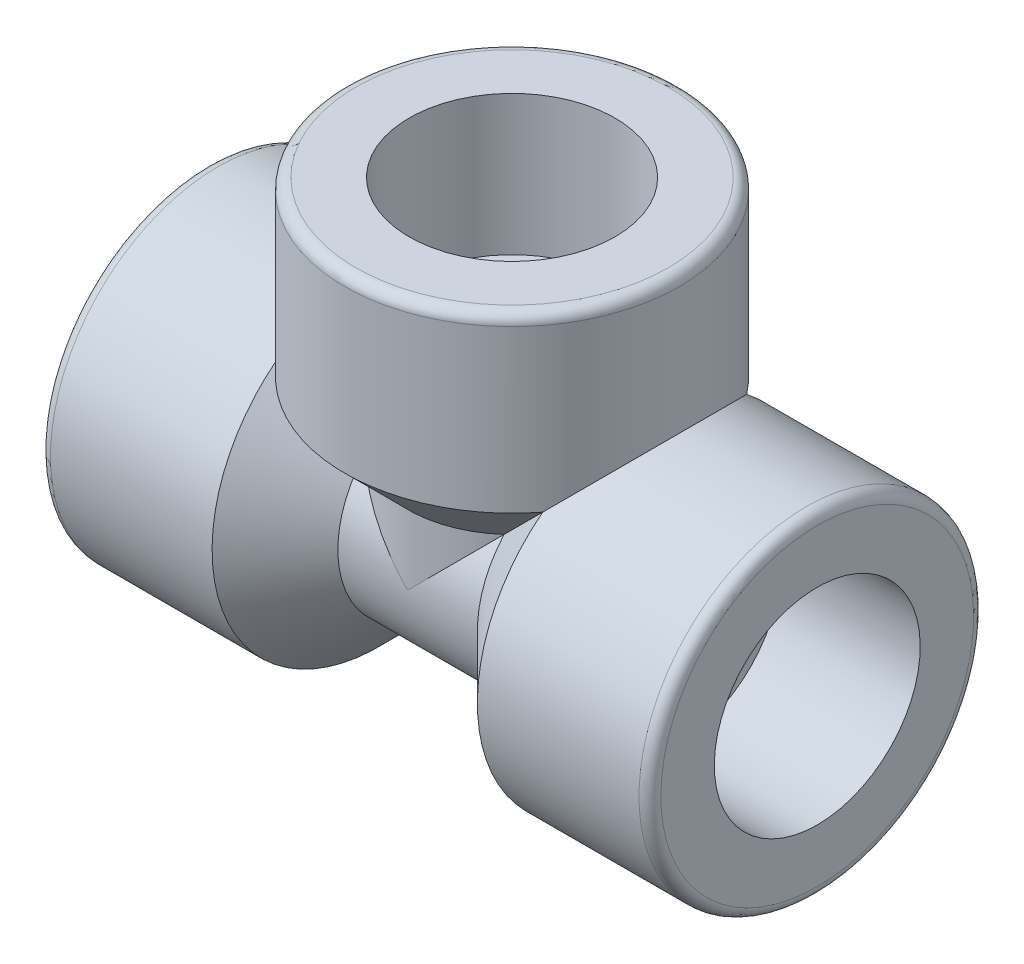
ISO-10303-21;
HEADER;
FILE_DESCRIPTION(('STEP AP214'),'2;1');
FILE_NAME('part.step','',(''),(''),'','','');
FILE_SCHEMA(('AUTOMOTIVE_DESIGN { 1 0 10303 214 1 1 1 1 }'));
ENDSEC;
DATA;
#1=APPLICATION_CONTEXT('core data for automotive mechanical design processes');
#2=APPLICATION_PROTOCOL_DEFINITION('international standard','automotive_design',2000,#1);
#3=PRODUCT_CONTEXT('',#1,'mechanical');
#4=PRODUCT('Part','Part','',(#3));
#5=PRODUCT_RELATED_PRODUCT_CATEGORY('part','',(#4));
#6=PRODUCT_DEFINITION_FORMATION('','',#4);
#7=PRODUCT_DEFINITION_CONTEXT('part definition',#1,'design');
#8=PRODUCT_DEFINITION('design','',#6,#7);
#9=PRODUCT_DEFINITION_SHAPE('','',#8);
#10=(LENGTH_UNIT() NAMED_UNIT(*) SI_UNIT(.MILLI.,.METRE.));
#11=(NAMED_UNIT(*) PLANE_ANGLE_UNIT() SI_UNIT($,.RADIAN.));
#12=(NAMED_UNIT(*) SI_UNIT($,.STERADIAN.) SOLID_ANGLE_UNIT());
#13=UNCERTAINTY_MEASURE_WITH_UNIT(LENGTH_MEASURE(1.E-05),#10,'distance_accuracy_value','');
#14=(GEOMETRIC_REPRESENTATION_CONTEXT(3) GLOBAL_UNCERTAINTY_ASSIGNED_CONTEXT((#13)) GLOBAL_UNIT_ASSIGNED_CONTEXT((#10,
#11,#12)) REPRESENTATION_CONTEXT('',''));
#15=CARTESIAN_POINT('',(0.,0.,0.));
#16=DIRECTION('',(0.,0.,1.));
#17=DIRECTION('',(1.,0.,0.));
#18=AXIS2_PLACEMENT_3D('',#15,#16,#17);
#19=CARTESIAN_POINT('',(0.,0.,0.));
#20=DIRECTION('',(1.,0.,0.));
#21=DIRECTION('',(0.,1.,0.));
#22=AXIS2_PLACEMENT_3D('',#19,#20,#21);
#23=CYLINDRICAL_SURFACE('',#22,4.191);
#24=CARTESIAN_POINT('',(11.43,0.,0.));
#25=DIRECTION('',(-1.,0.,0.));
#26=DIRECTION('',(0.,-1.,0.));
#27=AXIS2_PLACEMENT_3D('',#24,#25,#26);
#28=CIRCLE('',#27,4.191);
#29=CARTESIAN_POINT('',(11.43,-4.19100000000007,0.));
#30=VERTEX_POINT('',#29);
#31=EDGE_CURVE('E159',#30,#30,#28,.T.);
#32=ORIENTED_EDGE('',*,*,#31,.F.);
#33=EDGE_LOOP('',(#32));
#34=FACE_BOUND('',#33,.T.);
#35=CARTESIAN_POINT('',(-11.43,0.,0.));
#36=DIRECTION('',(1.,0.,0.));
#37=DIRECTION('',(0.,1.,0.));
#38=AXIS2_PLACEMENT_3D('',#35,#36,#37);
#39=CIRCLE('',#38,4.191);
#40=CARTESIAN_POINT('',(-11.43,4.19099999999999,0.));
#41=VERTEX_POINT('',#40);
#42=EDGE_CURVE('E288',#41,#41,#39,.T.);
#43=ORIENTED_EDGE('',*,*,#42,.F.);
#44=EDGE_LOOP('',(#43));
#45=FACE_BOUND('',#44,.T.);
#46=CARTESIAN_POINT('',(0.,0.,0.));
#47=DIRECTION('',(0.707106781186548,-0.707106781186548,0.));
#48=DIRECTION('',(0.707106781186548,0.707106781186547,0.));
#49=AXIS2_PLACEMENT_3D('',#46,#47,#48);
#50=ELLIPSE('',#49,5.92696903990564,4.191);
#51=CARTESIAN_POINT('',(0.,0.,-4.191));
#52=VERTEX_POINT('',#51);
#53=CARTESIAN_POINT('',(0.,0.,4.191));
#54=VERTEX_POINT('',#53);
#55=EDGE_CURVE('E110',#52,#54,#50,.T.);
#56=ORIENTED_EDGE('',*,*,#55,.F.);
#57=CARTESIAN_POINT('',(0.,0.,0.));
#58=DIRECTION('',(0.707106781186548,0.707106781186547,0.));
#59=DIRECTION('',(0.707106781186548,-0.707106781186548,0.));
#60=AXIS2_PLACEMENT_3D('',#57,#58,#59);
#61=ELLIPSE('',#60,5.92696903990564,4.191);
#62=EDGE_CURVE('E147',#54,#52,#61,.F.);
#63=ORIENTED_EDGE('',*,*,#62,.F.);
#64=EDGE_LOOP('',(#56,#63));
#65=FACE_BOUND('',#64,.T.);
#66=ADVANCED_FACE('F96',(#34,#45,#65),#23,.F.);
#67=CARTESIAN_POINT('',(0.,0.,0.));
#68=DIRECTION('',(1.,0.,0.));
#69=DIRECTION('',(0.,1.,0.));
#70=AXIS2_PLACEMENT_3D('',#67,#68,#69);
#71=CYLINDRICAL_SURFACE('',#70,11.557);
#72=CARTESIAN_POINT('',(-20.32635,0.,0.));
#73=DIRECTION('',(1.,0.,0.));
#74=DIRECTION('',(0.,1.,0.));
#75=AXIS2_PLACEMENT_3D('',#72,#73,#74);
#76=CIRCLE('',#75,11.557);
#77=CARTESIAN_POINT('',(-20.32635,11.557,0.));
#78=VERTEX_POINT('',#77);
#79=EDGE_CURVE('E104',#78,#78,#76,.T.);
#80=ORIENTED_EDGE('',*,*,#79,.T.);
#81=EDGE_LOOP('',(#80));
#82=FACE_BOUND('',#81,.T.);
#83=CARTESIAN_POINT('',(0.,0.,0.));
#84=DIRECTION('',(0.707106781186549,0.707106781186546,0.));
#85=DIRECTION('',(0.707106781186546,-0.707106781186549,0.));
#86=AXIS2_PLACEMENT_3D('',#83,#84,#85);
#87=ELLIPSE('',#86,16.3440661403458,11.557);
#88=CARTESIAN_POINT('',(-9.16304999999999,9.16305000000002,-7.04292295126813));
#89=VERTEX_POINT('',#88);
#90=CARTESIAN_POINT('',(-9.16304999999999,9.16305000000003,7.04292295126813));
#91=VERTEX_POINT('',#90);
#92=EDGE_CURVE('E117',#89,#91,#87,.T.);
#93=ORIENTED_EDGE('',*,*,#92,.F.);
#94=CARTESIAN_POINT('',(-9.16305,0.,0.));
#95=DIRECTION('',(1.,0.,0.));
#96=DIRECTION('',(0.,1.,0.));
#97=AXIS2_PLACEMENT_3D('',#94,#95,#96);
#98=CIRCLE('',#97,11.557);
#99=EDGE_CURVE('E294',#91,#89,#98,.T.);
#100=ORIENTED_EDGE('',*,*,#99,.F.);
#101=EDGE_LOOP('',(#93,#100));
#102=FACE_BOUND('',#101,.T.);
#103=ADVANCED_FACE('F243',(#82,#102),#71,.T.);
#104=CARTESIAN_POINT('',(-9.16305,0.,0.));
#105=DIRECTION('',(-1.,0.,0.));
#106=DIRECTION('',(0.,-1.,0.));
#107=AXIS2_PLACEMENT_3D('',#104,#105,#106);
#108=CONICAL_SURFACE('',#107,11.557,0.785398163397451);
#109=CARTESIAN_POINT('',(1.19697500001641,-1.19697500001643,4.4342035988794E-06));
#110=CARTESIAN_POINT('',(1.19697836620666,-1.19697836620423,-0.0376505705711459));
#111=CARTESIAN_POINT('',(1.19608613541275,-1.19608613540982,-0.0752938622259102));
#112=CARTESIAN_POINT('',(1.19254436069482,-1.19254436069239,-0.150401745617256));
#113=CARTESIAN_POINT('',(1.18989543995814,-1.18989543995672,-0.187866395981631));
#114=CARTESIAN_POINT('',(1.17939486010733,-1.1793948601077,-0.299466042307876));
#115=CARTESIAN_POINT('',(1.16898874466563,-1.16898874466556,-0.373145913181798));
#116=CARTESIAN_POINT('',(1.14229768219998,-1.14229768219964,-0.516557276062976));
#117=CARTESIAN_POINT('',(1.12614636715457,-1.12614636715439,-0.586339887954223));
#118=CARTESIAN_POINT('',(1.08873038336302,-1.08873038336298,-0.723152238154118));
#119=CARTESIAN_POINT('',(1.06746102034273,-1.06746102034267,-0.790179382681073));
#120=CARTESIAN_POINT('',(1.02180582651157,-1.02180582651151,-0.917917484823124));
#121=CARTESIAN_POINT('',(0.997625241455938,-0.997625241455905,-0.978776926741604));
#122=CARTESIAN_POINT('',(0.946060780068239,-0.946060780068226,-1.09767143684221));
#123=CARTESIAN_POINT('',(0.91867764128022,-0.918677641280203,-1.15570715098273));
#124=CARTESIAN_POINT('',(0.832254105448934,-0.832254105448912,-1.32637374393476));
#125=CARTESIAN_POINT('',(0.769179137362862,-0.769179137362846,-1.43492836300394));
#126=CARTESIAN_POINT('',(0.640377669111118,-0.640377669111109,-1.63531666088378));
#127=CARTESIAN_POINT('',(0.575131914273946,-0.575131914273939,-1.72778686550953));
#128=CARTESIAN_POINT('',(0.440201699604737,-0.440201699604734,-1.90558001014071));
#129=CARTESIAN_POINT('',(0.370525893855268,-0.370525893855269,-1.99091617438732));
#130=CARTESIAN_POINT('',(0.226850905695857,-0.226850905695859,-2.15680932278225));
#131=CARTESIAN_POINT('',(0.152806219096202,-0.152806219096201,-2.23728670692094));
#132=CARTESIAN_POINT('',(0.00206906022920148,-0.00206906022919983,-2.39314866258522));
#133=CARTESIAN_POINT('',(-0.0746241137424896,0.0746241137424894,-2.46853186854515));
#134=CARTESIAN_POINT('',(-0.225511065887696,0.225511065887695,-2.61064517767748));
#135=CARTESIAN_POINT('',(-0.299588591410893,0.299588591410891,-2.677623507081));
#136=CARTESIAN_POINT('',(-0.449216998526755,0.449216998526755,-2.80821270787426));
#137=CARTESIAN_POINT('',(-0.524768023636592,0.524768023636592,-2.87182324898128));
#138=CARTESIAN_POINT('',(-0.752505323377614,0.752505323377615,-3.05765742051496));
#139=CARTESIAN_POINT('',(-0.906470895010872,0.906470895010871,-3.17552451823402));
#140=CARTESIAN_POINT('',(-1.22077330781734,1.22077330781734,-3.40429728513316));
#141=CARTESIAN_POINT('',(-1.38117591445579,1.38117591445579,-3.51501991967286));
#142=CARTESIAN_POINT('',(-1.70474656907484,1.70474656907484,-3.72888530479324));
#143=CARTESIAN_POINT('',(-1.86791815238902,1.86791815238902,-3.83201730104152));
#144=CARTESIAN_POINT('',(-2.2693005762169,2.2693005762169,-4.07640708832778));
#145=CARTESIAN_POINT('',(-2.5085666082519,2.5085666082519,-4.21418886034261));
#146=CARTESIAN_POINT('',(-2.98998716639616,2.98998716639617,-4.47931662528661));
#147=CARTESIAN_POINT('',(-3.23214213696036,3.23214213696037,-4.60666098810027));
#148=CARTESIAN_POINT('',(-3.71857634660193,3.71857634660194,-4.852867354527));
#149=CARTESIAN_POINT('',(-3.96285548011577,3.96285548011577,-4.97172977699078));
#150=CARTESIAN_POINT('',(-4.45307442708693,4.45307442708694,-5.20241628188884));
#151=CARTESIAN_POINT('',(-4.69901432165255,4.69901432165256,-5.31424001777425));
#152=CARTESIAN_POINT('',(-5.43479618372402,5.43479618372403,-5.63907088831386));
#153=CARTESIAN_POINT('',(-5.92655595657114,5.92655595657115,-5.84339370881202));
#154=CARTESIAN_POINT('',(-6.91340923267632,6.91340923267634,-6.23455831723592));
#155=CARTESIAN_POINT('',(-7.40850220970608,7.4085022097061,-6.42140279824828));
#156=CARTESIAN_POINT('',(-8.5920904066062,8.59209040660622,-6.85064949322347));
#157=CARTESIAN_POINT('',(-9.28172109306981,9.28172109306984,-7.08677498511869));
#158=CARTESIAN_POINT('',(-10.6642645502998,10.6642645502999,-7.53932345815605));
#159=CARTESIAN_POINT('',(-11.3571777398874,11.3571777398874,-7.75574384973766));
#160=CARTESIAN_POINT('',(-12.7495452918229,12.7495452918229,-8.17426388250147));
#161=CARTESIAN_POINT('',(-13.44901384512,13.4490138451201,-8.37626877130608));
#162=CARTESIAN_POINT('',(-14.4994490088823,14.4994490088824,-8.66962631683147));
#163=CARTESIAN_POINT('',(-14.8497498014326,14.8497498014326,-8.76579094339621));
#164=CARTESIAN_POINT('',(-15.5507431988797,15.5507431988798,-8.95518609790618));
#165=CARTESIAN_POINT('',(-15.9014357985876,15.9014357985876,-9.04841666424365));
#166=CARTESIAN_POINT('',(-16.2523030226211,16.2523030226211,-9.14031718511586));
#167=B_SPLINE_CURVE_WITH_KNOTS('',3,(#109,#110,#111,#112,#113,#114,#115,#116,#117,#118,#119,
#120,#121,#122,#123,#124,#125,#126,#127,#128,#129,#130,#131,#132,#133,#134,#135,#136,#137,#138,
#139,#140,#141,#142,#143,#144,#145,#146,#147,#148,#149,#150,#151,#152,#153,#154,#155,#156,#157,
#158,#159,#160,#161,#162,#163,#164,#165,#166),.UNSPECIFIED.,.F.,.F.,(4,2,2,2,2,2,2,2,2,2,2,2,2,
2,2,2,2,2,2,2,2,2,2,2,2,2,2,2,4),(0.,0.112921576811569,0.2258031160053,0.450556616219099,
0.670391751304081,0.890429292952005,1.09962282808023,1.30876828072101,1.72920119538149,
2.12071729340295,2.51149076348252,2.90751364595729,3.30364227020766,3.67659711967938,
4.04958847774958,4.79205608614872,5.54915999472527,6.30731669685217,7.40312539873707,
8.49910491929498,9.59503028126114,10.6910095588379,12.8651998588656,15.0390546029517,
18.049139580089,21.0596195605723,24.0883467620669,25.6022820115838,27.1161974429796),.UNSPECIFIED.);
#168=CARTESIAN_POINT('',(-4.81965000000002,4.81965000000002,-5.36721518457195));
#169=VERTEX_POINT('',#168);
#170=EDGE_CURVE('E274',#169,#89,#167,.T.);
#171=ORIENTED_EDGE('',*,*,#170,.F.);
#172=CARTESIAN_POINT('',(-4.81965000000002,0.,0.));
#173=DIRECTION('',(1.,0.,0.));
#174=DIRECTION('',(0.,1.,0.));
#175=AXIS2_PLACEMENT_3D('',#172,#173,#174);
#176=CIRCLE('',#175,7.2136);
#177=CARTESIAN_POINT('',(-4.81965000000002,4.81965000000002,5.36721518457195));
#178=VERTEX_POINT('',#177);
#179=EDGE_CURVE('E291',#178,#169,#176,.T.);
#180=ORIENTED_EDGE('',*,*,#179,.F.);
#181=CARTESIAN_POINT('',(-16.0854125900472,16.0854125900472,9.09650172002422));
#182=CARTESIAN_POINT('',(-15.4339510477104,15.4339510477104,8.92495006252489));
#183=CARTESIAN_POINT('',(-14.7830664804659,14.783066480466,8.74890599160706));
#184=CARTESIAN_POINT('',(-13.4825170343036,13.4825170343037,8.38554939927521));
#185=CARTESIAN_POINT('',(-12.8328529838987,12.8328529838987,8.1982309594175));
#186=CARTESIAN_POINT('',(-11.4523427840635,11.4523427840635,7.78534805823336));
#187=CARTESIAN_POINT('',(-10.721766234564,10.7217662345641,7.55795905302697));
#188=CARTESIAN_POINT('',(-9.628722902629,9.62872290262903,7.20044870990384));
#189=CARTESIAN_POINT('',(-9.26490716180718,9.26490716180721,7.07856296971851));
#190=CARTESIAN_POINT('',(-8.53837371860589,8.53837371860592,6.82843683144562));
#191=CARTESIAN_POINT('',(-8.17565599271068,8.17565599271071,6.70019657048659));
#192=CARTESIAN_POINT('',(-7.46894056942904,7.46894056942907,6.44261722420037));
#193=CARTESIAN_POINT('',(-7.12487963760278,7.1248796376028,6.3136260358246));
#194=CARTESIAN_POINT('',(-6.43829917672166,6.43829917672168,6.04769566224292));
#195=CARTESIAN_POINT('',(-6.0957796143418,6.09577961434182,5.91075664977029));
#196=CARTESIAN_POINT('',(-5.41231293183799,5.412312931838,5.62714519981428));
#197=CARTESIAN_POINT('',(-5.07136813721994,5.07136813721996,5.48046149484933));
#198=CARTESIAN_POINT('',(-4.39220551291607,4.39220551291608,5.17530102861037));
#199=CARTESIAN_POINT('',(-4.05398703052978,4.05398703052979,5.01682718889586));
#200=CARTESIAN_POINT('',(-3.40735745009627,3.40735745009628,4.69772284873583));
#201=CARTESIAN_POINT('',(-3.098672176401,3.09867217640101,4.53821659689964));
#202=CARTESIAN_POINT('',(-2.63892143850963,2.63892143850964,4.28636114320928));
#203=CARTESIAN_POINT('',(-2.48614248669571,2.48614248669572,4.20026418354079));
#204=CARTESIAN_POINT('',(-2.18200613151679,2.1820061315168,4.02319275067455));
#205=CARTESIAN_POINT('',(-2.03064866796119,2.03064866796119,3.93221848510265));
#206=CARTESIAN_POINT('',(-1.72937060093615,1.72937060093615,3.74431582337524));
#207=CARTESIAN_POINT('',(-1.57945407736739,1.57945407736739,3.64737428037004));
#208=CARTESIAN_POINT('',(-1.28195932291795,1.28195932291795,3.44658856595852));
#209=CARTESIAN_POINT('',(-1.13438085421445,1.13438085421445,3.34274510225873));
#210=CARTESIAN_POINT('',(-0.84252062063191,0.842520620631908,3.12675251979719));
#211=CARTESIAN_POINT('',(-0.698234514074487,0.698234514074483,3.01461527885065));
#212=CARTESIAN_POINT('',(-0.485112848355794,0.48511284835579,2.83850158909801));
#213=CARTESIAN_POINT('',(-0.41463646990944,0.414636469909438,2.7784910688848));
#214=CARTESIAN_POINT('',(-0.275009416736295,0.275009416736294,2.65546674204897));
#215=CARTESIAN_POINT('',(-0.205858641577127,0.205858641577128,2.59245316421967));
#216=CARTESIAN_POINT('',(-0.0603972809061026,0.0603972809061043,2.45469154875406));
#217=CARTESIAN_POINT('',(0.0156930150347754,-0.0156930150347735,2.37947549517443));
#218=CARTESIAN_POINT('',(0.165201781596407,-0.165201781596405,2.22397690872858));
#219=CARTESIAN_POINT('',(0.238621466927465,-0.238621466927463,2.14369672585511));
#220=CARTESIAN_POINT('',(0.380829912622356,-0.380829912622353,1.97846843786975));
#221=CARTESIAN_POINT('',(0.449674576272804,-0.449674576272801,1.89361750921734));
#222=CARTESIAN_POINT('',(0.582963846973055,-0.582963846973053,1.71687379584102));
#223=CARTESIAN_POINT('',(0.647399829764682,-0.647399829764683,1.62496791538749));
#224=CARTESIAN_POINT('',(0.774547331373884,-0.774547331373879,1.42589356088552));
#225=CARTESIAN_POINT('',(0.83678339378687,-0.836783393786855,1.31809968973217));
#226=CARTESIAN_POINT('',(0.922038223437998,-0.922038223437981,1.14870454232127));
#227=CARTESIAN_POINT('',(0.949048443063641,-0.949048443063625,1.09111076241334));
#228=CARTESIAN_POINT('',(0.999906854131563,-0.99990685413152,0.973151884775891));
#229=CARTESIAN_POINT('',(1.02375432180886,-1.02375432180879,0.912786156953264));
#230=CARTESIAN_POINT('',(1.06887130419532,-1.06887130419528,0.785870182721644));
#231=CARTESIAN_POINT('',(1.08992247138616,-1.08992247138618,0.719162823306451));
#232=CARTESIAN_POINT('',(1.12694563962336,-1.12694563962316,0.583027930088218));
#233=CARTESIAN_POINT('',(1.14292218499438,-1.14292218499391,0.51360289291272));
#234=CARTESIAN_POINT('',(1.16931558766293,-1.16931558766304,0.370965823635463));
#235=CARTESIAN_POINT('',(1.17960141602561,-1.1796014160266,0.297703966159117));
#236=CARTESIAN_POINT('',(1.18997927857259,-1.18997927857111,0.186751235930064));
#237=CARTESIAN_POINT('',(1.19259690567115,-1.1925969056682,0.149507590766732));
#238=CARTESIAN_POINT('',(1.1960967098688,-1.19609670986497,0.074845007269023));
#239=CARTESIAN_POINT('',(1.19697828510917,-1.19697828510592,0.0374260126489613));
#240=CARTESIAN_POINT('',(1.19697500001678,-1.1969750000168,-4.48349426405145E-06));
#241=B_SPLINE_CURVE_WITH_KNOTS('',3,(#181,#182,#183,#184,#185,#186,#187,#188,#189,#190,#191,
#192,#193,#194,#195,#196,#197,#198,#199,#200,#201,#202,#203,#204,#205,#206,#207,#208,#209,#210,
#211,#212,#213,#214,#215,#216,#217,#218,#219,#220,#221,#222,#223,#224,#225,#226,#227,#228,#229,
#230,#231,#232,#233,#234,#235,#236,#237,#238,#239,#240),.UNSPECIFIED.,.F.,.F.,(4,2,2,2,2,2,2,2,
2,2,2,2,2,2,2,2,2,2,2,2,2,2,2,2,2,2,2,2,2,4),(0.,2.81143945539082,5.62436786141535,
8.79790579740941,10.3841339751362,11.9703279374561,13.4804215240812,14.9904823035136,
16.5023205762627,18.0137854599248,19.4078138368868,20.1055199143439,20.8031963141544,
21.5024690031235,22.2016701006219,22.8998885456742,23.248866689735,23.5978182886431,
23.9915604790179,24.3851212799136,24.7722800270107,25.1601756730447,25.5766027412811,
25.7837708578784,25.9909863013789,26.2097740667027,26.4283653515335,26.6517999466681,
26.7640098711448,26.8762586899902),.UNSPECIFIED.);
#242=EDGE_CURVE('E267',#91,#178,#241,.T.);
#243=ORIENTED_EDGE('',*,*,#242,.F.);
#244=ORIENTED_EDGE('',*,*,#99,.T.);
#245=EDGE_LOOP('',(#171,#180,#243,#244));
#246=FACE_BOUND('',#245,.T.);
#247=ADVANCED_FACE('F249',(#246),#108,.T.);
#248=CARTESIAN_POINT('',(0.,0.,0.));
#249=DIRECTION('',(1.,0.,0.));
#250=DIRECTION('',(0.,1.,0.));
#251=AXIS2_PLACEMENT_3D('',#248,#249,#250);
#252=CYLINDRICAL_SURFACE('',#251,7.2136);
#253=CARTESIAN_POINT('',(0.,0.,0.));
#254=DIRECTION('',(0.707106781186549,0.707106781186546,0.));
#255=DIRECTION('',(0.707106781186546,-0.707106781186549,0.));
#256=AXIS2_PLACEMENT_3D('',#253,#254,#255);
#257=ELLIPSE('',#256,10.2015709535345,7.2136);
#258=CARTESIAN_POINT('',(0.,0.,-7.2136));
#259=VERTEX_POINT('',#258);
#260=EDGE_CURVE('E517',#259,#169,#257,.T.);
#261=ORIENTED_EDGE('',*,*,#260,.F.);
#262=CARTESIAN_POINT('',(0.,0.,0.));
#263=DIRECTION('',(0.707106781186544,-0.707106781186551,0.));
#264=DIRECTION('',(-0.707106781186551,-0.707106781186544,0.));
#265=AXIS2_PLACEMENT_3D('',#262,#263,#264);
#266=ELLIPSE('',#265,10.2015709535345,7.2136);
#267=CARTESIAN_POINT('',(4.81965000000004,4.81965,-5.36721518457195));
#268=VERTEX_POINT('',#267);
#269=EDGE_CURVE('E177',#259,#268,#266,.T.);
#270=ORIENTED_EDGE('',*,*,#269,.T.);
#271=CARTESIAN_POINT('',(4.81965000000002,0.,0.));
#272=DIRECTION('',(-1.,0.,0.));
#273=DIRECTION('',(0.,-1.,0.));
#274=AXIS2_PLACEMENT_3D('',#271,#272,#273);
#275=CIRCLE('',#274,7.2136);
#276=CARTESIAN_POINT('',(4.81965000000004,4.81965,5.36721518457195));
#277=VERTEX_POINT('',#276);
#278=EDGE_CURVE('E162',#268,#277,#275,.T.);
#279=ORIENTED_EDGE('',*,*,#278,.T.);
#280=CARTESIAN_POINT('',(0.,0.,7.2136));
#281=VERTEX_POINT('',#280);
#282=EDGE_CURVE('E174',#277,#281,#266,.T.);
#283=ORIENTED_EDGE('',*,*,#282,.T.);
#284=EDGE_CURVE('E515',#178,#281,#257,.T.);
#285=ORIENTED_EDGE('',*,*,#284,.F.);
#286=ORIENTED_EDGE('',*,*,#179,.T.);
#287=EDGE_LOOP('',(#261,#270,#279,#283,#285,#286));
#288=FACE_BOUND('',#287,.T.);
#289=ADVANCED_FACE('F258',(#288),#252,.T.);
#290=CARTESIAN_POINT('',(-21.082,-7.112,0.));
#291=DIRECTION('',(1.,0.,0.));
#292=DIRECTION('',(0.,1.,0.));
#293=AXIS2_PLACEMENT_3D('',#290,#291,#292);
#294=PLANE('',#293);
#295=CARTESIAN_POINT('',(-21.082,0.,0.));
#296=DIRECTION('',(1.,0.,0.));
#297=DIRECTION('',(0.,1.,0.));
#298=AXIS2_PLACEMENT_3D('',#295,#296,#297);
#299=CIRCLE('',#298,10.80135);
#300=CARTESIAN_POINT('',(-21.082,10.80135,0.));
#301=VERTEX_POINT('',#300);
#302=EDGE_CURVE('E12',#301,#301,#299,.T.);
#303=ORIENTED_EDGE('',*,*,#302,.F.);
#304=EDGE_LOOP('',(#303));
#305=FACE_BOUND('',#304,.T.);
#306=CARTESIAN_POINT('',(-21.082,0.,0.));
#307=DIRECTION('',(1.,0.,0.));
#308=DIRECTION('',(0.,1.,0.));
#309=AXIS2_PLACEMENT_3D('',#306,#307,#308);
#310=CIRCLE('',#309,7.112);
#311=CARTESIAN_POINT('',(-21.082,7.112,0.));
#312=VERTEX_POINT('',#311);
#313=EDGE_CURVE('E282',#312,#312,#310,.T.);
#314=ORIENTED_EDGE('',*,*,#313,.T.);
#315=EDGE_LOOP('',(#314));
#316=FACE_BOUND('',#315,.T.);
#317=ADVANCED_FACE('F98',(#305,#316),#294,.F.);
#318=CARTESIAN_POINT('',(-20.32635,0.,0.));
#319=DIRECTION('',(1.,0.,0.));
#320=DIRECTION('',(0.,1.,0.));
#321=AXIS2_PLACEMENT_3D('',#318,#319,#320);
#322=TOROIDAL_SURFACE('',#321,10.80135,0.75565);
#323=ORIENTED_EDGE('',*,*,#79,.F.);
#324=EDGE_LOOP('',(#323));
#325=FACE_BOUND('',#324,.T.);
#326=ORIENTED_EDGE('',*,*,#302,.T.);
#327=EDGE_LOOP('',(#326));
#328=FACE_BOUND('',#327,.T.);
#329=ADVANCED_FACE('F298',(#325,#328),#322,.T.);
#330=CARTESIAN_POINT('',(-11.43,-7.112,0.));
#331=DIRECTION('',(1.,0.,0.));
#332=DIRECTION('',(0.,1.,0.));
#333=AXIS2_PLACEMENT_3D('',#330,#331,#332);
#334=PLANE('',#333);
#335=CARTESIAN_POINT('',(-11.43,0.,0.));
#336=DIRECTION('',(1.,0.,0.));
#337=DIRECTION('',(0.,1.,0.));
#338=AXIS2_PLACEMENT_3D('',#335,#336,#337);
#339=CIRCLE('',#338,7.112);
#340=CARTESIAN_POINT('',(-11.43,7.11199999999999,0.));
#341=VERTEX_POINT('',#340);
#342=EDGE_CURVE('E285',#341,#341,#339,.T.);
#343=ORIENTED_EDGE('',*,*,#342,.F.);
#344=EDGE_LOOP('',(#343));
#345=FACE_BOUND('',#344,.T.);
#346=ORIENTED_EDGE('',*,*,#42,.T.);
#347=EDGE_LOOP('',(#346));
#348=FACE_BOUND('',#347,.T.);
#349=ADVANCED_FACE('F256',(#345,#348),#334,.F.);
#350=CARTESIAN_POINT('',(0.,0.,0.));
#351=DIRECTION('',(1.,0.,0.));
#352=DIRECTION('',(0.,1.,0.));
#353=AXIS2_PLACEMENT_3D('',#350,#351,#352);
#354=CYLINDRICAL_SURFACE('',#353,7.112);
#355=ORIENTED_EDGE('',*,*,#313,.F.);
#356=EDGE_LOOP('',(#355));
#357=FACE_BOUND('',#356,.T.);
#358=ORIENTED_EDGE('',*,*,#342,.T.);
#359=EDGE_LOOP('',(#358));
#360=FACE_BOUND('',#359,.T.);
#361=ADVANCED_FACE('F307',(#357,#360),#354,.F.);
#362=CARTESIAN_POINT('',(0.,0.,0.));
#363=DIRECTION('',(0.,-1.,0.));
#364=DIRECTION('',(1.,0.,0.));
#365=AXIS2_PLACEMENT_3D('',#362,#363,#364);
#366=CYLINDRICAL_SURFACE('',#365,11.557);
#367=CARTESIAN_POINT('',(0.,20.32635,0.));
#368=DIRECTION('',(0.,-1.,0.));
#369=DIRECTION('',(1.,0.,0.));
#370=AXIS2_PLACEMENT_3D('',#367,#368,#369);
#371=CIRCLE('',#370,11.557);
#372=CARTESIAN_POINT('',(11.5570000000001,20.32635,0.));
#373=VERTEX_POINT('',#372);
#374=EDGE_CURVE('E511',#373,#373,#371,.T.);
#375=ORIENTED_EDGE('',*,*,#374,.T.);
#376=EDGE_LOOP('',(#375));
#377=FACE_BOUND('',#376,.T.);
#378=CARTESIAN_POINT('',(0.,9.16305,0.));
#379=DIRECTION('',(0.,-1.,0.));
#380=DIRECTION('',(1.,0.,0.));
#381=AXIS2_PLACEMENT_3D('',#378,#379,#380);
#382=CIRCLE('',#381,11.557);
#383=CARTESIAN_POINT('',(9.16305000000006,9.16304999999996,-7.04292295126813));
#384=VERTEX_POINT('',#383);
#385=EDGE_CURVE('E523',#89,#384,#382,.T.);
#386=ORIENTED_EDGE('',*,*,#385,.F.);
#387=ORIENTED_EDGE('',*,*,#92,.T.);
#388=CARTESIAN_POINT('',(9.16304999999969,9.16304999999996,7.0429229512686));
#389=VERTEX_POINT('',#388);
#390=EDGE_CURVE('E518',#389,#91,#382,.T.);
#391=ORIENTED_EDGE('',*,*,#390,.F.);
#392=CARTESIAN_POINT('',(0.,0.,0.));
#393=DIRECTION('',(0.707106781186544,-0.707106781186551,0.));
#394=DIRECTION('',(-0.707106781186551,-0.707106781186544,0.));
#395=AXIS2_PLACEMENT_3D('',#392,#393,#394);
#396=ELLIPSE('',#395,16.3440661403458,11.557);
#397=EDGE_CURVE('E536',#384,#389,#396,.T.);
#398=ORIENTED_EDGE('',*,*,#397,.F.);
#399=EDGE_LOOP('',(#386,#387,#391,#398));
#400=FACE_BOUND('',#399,.T.);
#401=ADVANCED_FACE('F310',(#377,#400),#366,.T.);
#402=CARTESIAN_POINT('',(0.,9.16305,0.));
#403=DIRECTION('',(0.,1.,0.));
#404=DIRECTION('',(-1.,0.,0.));
#405=AXIS2_PLACEMENT_3D('',#402,#403,#404);
#406=CONICAL_SURFACE('',#405,11.557,0.785398163397451);
#407=CARTESIAN_POINT('',(0.,4.81965000000002,0.));
#408=DIRECTION('',(0.,-1.,0.));
#409=DIRECTION('',(1.,0.,0.));
#410=AXIS2_PLACEMENT_3D('',#407,#408,#409);
#411=CIRCLE('',#410,7.2136);
#412=EDGE_CURVE('E527',#169,#268,#411,.T.);
#413=ORIENTED_EDGE('',*,*,#412,.F.);
#414=ORIENTED_EDGE('',*,*,#170,.T.);
#415=ORIENTED_EDGE('',*,*,#385,.T.);
#416=CARTESIAN_POINT('',(-1.19697500001644,-1.19697500001641,4.43422217016995E-06));
#417=CARTESIAN_POINT('',(-1.19697836619267,-1.19697836619538,-0.0376505386649304));
#418=CARTESIAN_POINT('',(-1.19608613691645,-1.1960861369197,-0.0752937984624332));
#419=CARTESIAN_POINT('',(-1.19254436817819,-1.19254436818083,-0.150401618609833));
#420=CARTESIAN_POINT('',(-1.18989545190044,-1.18989545190192,-0.187866237587186));
#421=CARTESIAN_POINT('',(-1.17939488953394,-1.17939488953341,-0.299465792016909));
#422=CARTESIAN_POINT('',(-1.168988791229,-1.16898879122904,-0.373145603509555));
#423=CARTESIAN_POINT('',(-1.14229777111418,-1.14229777111455,-0.51655685666126));
#424=CARTESIAN_POINT('',(-1.12614648089239,-1.12614648089253,-0.586339418011595));
#425=CARTESIAN_POINT('',(-1.08873055285983,-1.0887305528598,-0.723151672504108));
#426=CARTESIAN_POINT('',(-1.06746122079399,-1.06746122079402,-0.790178771877227));
#427=CARTESIAN_POINT('',(-1.02180609075679,-1.02180609075685,-0.917916793046498));
#428=CARTESIAN_POINT('',(-0.997625538226719,-0.997625538226755,-0.978776198803777));
#429=CARTESIAN_POINT('',(-0.946061144233819,-0.946061144233828,-1.09767064078424));
#430=CARTESIAN_POINT('',(-0.918678040312007,-0.918678040312017,-1.15570632296268));
#431=CARTESIAN_POINT('',(-0.832254612246659,-0.832254612246669,-1.3263728238699));
#432=CARTESIAN_POINT('',(-0.769179719464725,-0.76917971946473,-1.43492738821844));
#433=CARTESIAN_POINT('',(-0.64037839843336,-0.640378398433358,-1.63531559055353));
#434=CARTESIAN_POINT('',(-0.575132715301004,-0.575132715301003,-1.72778575364432));
#435=CARTESIAN_POINT('',(-0.440202644525717,-0.440202644525715,-1.90557882126733));
#436=CARTESIAN_POINT('',(-0.37052691094885,-0.370526910948847,-1.99091495000715));
#437=CARTESIAN_POINT('',(-0.226852068920373,-0.226852068920371,-2.15680803032537));
#438=CARTESIAN_POINT('',(-0.152807456309187,-0.152807456309185,-2.23728538199531));
#439=CARTESIAN_POINT('',(-0.00207044549341677,-0.00207044549341592,-2.39314727585173));
#440=CARTESIAN_POINT('',(0.074622654415967,0.0746226544159676,-2.46853045247247));
#441=CARTESIAN_POINT('',(0.225509475846285,0.225509475846283,-2.61064371924248));
#442=CARTESIAN_POINT('',(0.299586945037569,0.299586945037564,-2.67762203479675));
#443=CARTESIAN_POINT('',(0.449215240033559,0.449215240033553,-2.80821120847576));
#444=CARTESIAN_POINT('',(0.52476620935568,0.524766209355676,-2.87182173631741));
#445=CARTESIAN_POINT('',(0.752503343168397,0.752503343168393,-3.05765586909326));
#446=CARTESIAN_POINT('',(0.906468805311294,0.90646880531129,-3.17552294199359));
#447=CARTESIAN_POINT('',(1.2207709995059,1.22077099950589,-3.40429566109838));
#448=CARTESIAN_POINT('',(1.38117349707537,1.38117349707536,-3.51501827260467));
#449=CARTESIAN_POINT('',(1.7047439341416,1.70474393414158,-3.72888361250545));
#450=CARTESIAN_POINT('',(1.86791540897135,1.86791540897134,-3.83201558657428));
#451=CARTESIAN_POINT('',(2.26929782709508,2.26929782709505,-4.07640547836332));
#452=CARTESIAN_POINT('',(2.50856396664689,2.50856396664687,-4.21418736301104));
#453=CARTESIAN_POINT('',(2.98998474589817,2.98998474589814,-4.47931533469251));
#454=CARTESIAN_POINT('',(3.23213983005518,3.23213983005514,-4.60665979160166));
#455=CARTESIAN_POINT('',(3.71857427121294,3.7185742712129,-4.85286633294578));
#456=CARTESIAN_POINT('',(3.96285352265388,3.96285352265384,-4.97172883621665));
#457=CARTESIAN_POINT('',(4.45307270816347,4.45307270816343,-5.20241549257506));
#458=CARTESIAN_POINT('',(4.69901272334075,4.69901272334071,-5.31423929911235));
#459=CARTESIAN_POINT('',(5.43479494814157,5.43479494814151,-5.63907036889284));
#460=CARTESIAN_POINT('',(5.92655496584885,5.92655496584879,-5.84339330656798));
#461=CARTESIAN_POINT('',(6.91340873502617,6.9134087350261,-6.23455812946449));
#462=CARTESIAN_POINT('',(7.40850196026343,7.40850196026335,-6.42140270779528));
#463=CARTESIAN_POINT('',(8.59209041149717,8.59209041149708,-6.85064949498162));
#464=CARTESIAN_POINT('',(9.28172110286824,9.28172110286815,-7.08677498847161));
#465=CARTESIAN_POINT('',(10.6642645702035,10.6642645702033,-7.53932346452615));
#466=CARTESIAN_POINT('',(11.3571777649899,11.3571777649898,-7.75574385752317));
#467=CARTESIAN_POINT('',(12.7495453172461,12.749545317246,-8.17426388990162));
#468=CARTESIAN_POINT('',(13.449013865631,13.4490138656309,-8.3762687771332));
#469=CARTESIAN_POINT('',(14.4994490218763,14.4994490218762,-8.66962632041101));
#470=CARTESIAN_POINT('',(14.8497498118318,14.8497498118317,-8.76579094622847));
#471=CARTESIAN_POINT('',(15.5507432040837,15.5507432040835,-8.95518609928957));
#472=CARTESIAN_POINT('',(15.9014358011909,15.9014358011908,-9.04841666492545));
#473=CARTESIAN_POINT('',(16.2523030226211,16.2523030226209,-9.14031718511585));
#474=B_SPLINE_CURVE_WITH_KNOTS('',3,(#416,#417,#418,#419,#420,#421,#422,#423,#424,#425,#426,
#427,#428,#429,#430,#431,#432,#433,#434,#435,#436,#437,#438,#439,#440,#441,#442,#443,#444,#445,
#446,#447,#448,#449,#450,#451,#452,#453,#454,#455,#456,#457,#458,#459,#460,#461,#462,#463,#464,
#465,#466,#467,#468,#469,#470,#471,#472,#473),.UNSPECIFIED.,.F.,.F.,(4,2,2,2,2,2,2,2,2,2,2,2,2,
2,2,2,2,2,2,2,2,2,2,2,2,2,2,2,4),(0.,0.112921481258617,0.225802925062556,0.450556237866055,
0.670391196932864,0.890428561817314,1.09962193505053,1.30876722599571,1.72919981176881,
2.12071560679727,2.51148877573913,2.90751134997468,3.3036396659746,3.67659429166114,
4.04958542597329,4.79205259024317,5.54915605257292,6.30731230730279,7.40312155820882,
8.49910162852108,9.59502754221779,10.6910073716909,12.8651987668423,15.0390546034192,
18.0491396019353,21.0596196048633,24.0883467849994,25.6022820232823,27.1161974434458),.UNSPECIFIED.);
#475=EDGE_CURVE('E187',#268,#384,#474,.T.);
#476=ORIENTED_EDGE('',*,*,#475,.F.);
#477=EDGE_LOOP('',(#413,#414,#415,#476));
#478=FACE_BOUND('',#477,.T.);
#479=ADVANCED_FACE('F193',(#478),#406,.T.);
#480=ORIENTED_EDGE('',*,*,#390,.T.);
#481=ORIENTED_EDGE('',*,*,#242,.T.);
#482=EDGE_CURVE('E524',#277,#178,#411,.T.);
#483=ORIENTED_EDGE('',*,*,#482,.F.);
#484=CARTESIAN_POINT('',(12.0509957954128,12.0509957954127,7.96429277283102));
#485=CARTESIAN_POINT('',(11.5398150198831,11.539815019883,7.81054001475397));
#486=CARTESIAN_POINT('',(11.0292311524269,11.0292311524267,7.65271176736087));
#487=CARTESIAN_POINT('',(10.0095115569455,10.0095115569454,7.32683359048843));
#488=CARTESIAN_POINT('',(9.50037640238698,9.50037640238688,7.15878007997024));
#489=CARTESIAN_POINT('',(8.42498991524776,8.42498991524767,6.79020306505657));
#490=CARTESIAN_POINT('',(7.85899288063432,7.85899288063425,6.58817747757571));
#491=CARTESIAN_POINT('',(7.01278570139312,7.01278570139305,6.27045889114997));
#492=CARTESIAN_POINT('',(6.73119435370175,6.73119435370168,6.16211135526662));
#493=CARTESIAN_POINT('',(6.16913548587836,6.1691354858783,5.93974655549654));
#494=CARTESIAN_POINT('',(5.88866794028222,5.88866794028217,5.82572942087074));
#495=CARTESIAN_POINT('',(5.35849946673091,5.35849946673086,5.60338976447545));
#496=CARTESIAN_POINT('',(5.10866054580199,5.10866054580194,5.4957265724765));
#497=CARTESIAN_POINT('',(4.61036438487825,4.6103643848782,5.27420496623833));
#498=CARTESIAN_POINT('',(4.36190709575166,4.36190709575161,5.16034677387052));
#499=CARTESIAN_POINT('',(3.86663756931437,3.86663756931433,4.92523126713924));
#500=CARTESIAN_POINT('',(3.61982599198073,3.61982599198069,4.80397116161763));
#501=CARTESIAN_POINT('',(3.12850239998774,3.12850239998772,4.55255754657035));
#502=CARTESIAN_POINT('',(2.88399005969906,2.88399005969904,4.42240531864765));
#503=CARTESIAN_POINT('',(2.41460700999884,2.41460700999882,4.1602736549523));
#504=CARTESIAN_POINT('',(2.18953350324936,2.18953350324934,4.02902345576663));
#505=CARTESIAN_POINT('',(1.74293840552026,1.74293840552025,3.75432743159838));
#506=CARTESIAN_POINT('',(1.52141880261088,1.52141880261087,3.61087504526243));
#507=CARTESIAN_POINT('',(1.19291318578635,1.19291318578635,3.38352832358502));
#508=CARTESIAN_POINT('',(1.08386756237748,1.08386756237747,3.30558254289129));
#509=CARTESIAN_POINT('',(0.867520314577826,0.867520314577821,3.14500552655876));
#510=CARTESIAN_POINT('',(0.760218503603127,0.760218503603121,3.06237479650245));
#511=CARTESIAN_POINT('',(0.547917050411049,0.547917050411044,2.89165164390733));
#512=CARTESIAN_POINT('',(0.442915583324196,0.442915583324193,2.80356377985067));
#513=CARTESIAN_POINT('',(0.235840371748064,0.235840371748062,2.62079034630098));
#514=CARTESIAN_POINT('',(0.133765725218827,0.133765725218826,2.52610684110512));
#515=CARTESIAN_POINT('',(-0.0383540126388277,-0.0383540126388284,2.35635213775254));
#516=CARTESIAN_POINT('',(-0.109355373132545,-0.109355373132546,2.28322510984815));
#517=CARTESIAN_POINT('',(-0.248701477092516,-0.248701477092515,2.13212375804768));
#518=CARTESIAN_POINT('',(-0.317047324380778,-0.317047324380775,2.0541514839882));
#519=CARTESIAN_POINT('',(-0.449296218660017,-0.449296218660016,1.89371317633355));
#520=CARTESIAN_POINT('',(-0.513250835918893,-0.513250835918897,1.81133297157993));
#521=CARTESIAN_POINT('',(-0.636798870052422,-0.636798870052427,1.63994802065803));
#522=CARTESIAN_POINT('',(-0.696384800398397,-0.696384800398398,1.55093240661739));
#523=CARTESIAN_POINT('',(-0.81360384505328,-0.813603845053284,1.35848051656409));
#524=CARTESIAN_POINT('',(-0.870775390056558,-0.870775390056569,1.25446570036449));
#525=CARTESIAN_POINT('',(-0.9487958054922,-0.948795805492215,1.09141319055598));
#526=CARTESIAN_POINT('',(-0.973466988971404,-0.973466988971421,1.03602100847203));
#527=CARTESIAN_POINT('',(-1.01980975804904,-1.01980975804907,0.922745679175105));
#528=CARTESIAN_POINT('',(-1.04148080825853,-1.04148080825858,0.864862089767764));
#529=CARTESIAN_POINT('',(-1.08230596017195,-1.08230596017198,0.74356520108694));
#530=CARTESIAN_POINT('',(-1.10126798225918,-1.10126798225917,0.68002115769429));
#531=CARTESIAN_POINT('',(-1.13453752938946,-1.13453752938966,0.5505721931008));
#532=CARTESIAN_POINT('',(-1.1488484357087,-1.14884843570913,0.484669025808575));
#533=CARTESIAN_POINT('',(-1.17241007818505,-1.17241007818505,0.349645357533092));
#534=CARTESIAN_POINT('',(-1.18155503740862,-1.18155503740794,0.280486992708586));
#535=CARTESIAN_POINT('',(-1.19077105460251,-1.19077105460412,0.17587005099376));
#536=CARTESIAN_POINT('',(-1.19309292316633,-1.19309292316926,0.140786173676573));
#537=CARTESIAN_POINT('',(-1.19619632246382,-1.19619632246746,0.0704730339292969));
#538=CARTESIAN_POINT('',(-1.19697742922579,-1.19697742922884,0.0352437341549005));
#539=CARTESIAN_POINT('',(-1.19697500001976,-1.19697500001973,4.86198929021832E-06));
#540=B_SPLINE_CURVE_WITH_KNOTS('',3,(#484,#485,#486,#487,#488,#489,#490,#491,#492,#493,#494,
#495,#496,#497,#498,#499,#500,#501,#502,#503,#504,#505,#506,#507,#508,#509,#510,#511,#512,#513,
#514,#515,#516,#517,#518,#519,#520,#521,#522,#523,#524,#525,#526,#527,#528,#529,#530,#531,#532,
#533,#534,#535,#536,#537,#538,#539),.UNSPECIFIED.,.F.,.F.,(4,2,2,2,2,2,2,2,2,2,2,2,2,2,2,2,2,2,
2,2,2,2,2,2,2,2,2,4),(0.,2.21728187167101,4.43534478848777,6.91174794702038,8.1498347951912,
9.38789342920292,10.4959406289069,11.6039481704389,12.7123761385942,13.820644686999,
14.8533716829908,15.8866575500105,16.4049742096049,16.9232350404469,17.4410686444559,
17.9587408993535,18.3312725401604,18.7036476362712,19.070389290075,19.4377454032985,
19.8319695230377,20.0282144063794,20.2244942655919,20.4310873751243,20.6375299575336,
20.8480591901271,20.9537111086103,21.0593920952961),.UNSPECIFIED.);
#541=EDGE_CURVE('E178',#389,#277,#540,.T.);
#542=ORIENTED_EDGE('',*,*,#541,.F.);
#543=EDGE_LOOP('',(#480,#481,#483,#542));
#544=FACE_BOUND('',#543,.T.);
#545=ADVANCED_FACE('F233',(#544),#406,.T.);
#546=CARTESIAN_POINT('',(0.,0.,0.));
#547=DIRECTION('',(0.,-1.,0.));
#548=DIRECTION('',(1.,0.,0.));
#549=AXIS2_PLACEMENT_3D('',#546,#547,#548);
#550=CYLINDRICAL_SURFACE('',#549,7.2136);
#551=ORIENTED_EDGE('',*,*,#269,.F.);
#552=ORIENTED_EDGE('',*,*,#260,.T.);
#553=ORIENTED_EDGE('',*,*,#412,.T.);
#554=EDGE_LOOP('',(#551,#552,#553));
#555=FACE_BOUND('',#554,.T.);
#556=ADVANCED_FACE('F231',(#555),#550,.T.);
#557=ORIENTED_EDGE('',*,*,#482,.T.);
#558=ORIENTED_EDGE('',*,*,#284,.T.);
#559=ORIENTED_EDGE('',*,*,#282,.F.);
#560=EDGE_LOOP('',(#557,#558,#559));
#561=FACE_BOUND('',#560,.T.);
#562=ADVANCED_FACE('F229',(#561),#550,.T.);
#563=CARTESIAN_POINT('',(0.,0.,0.));
#564=DIRECTION('',(0.,-1.,0.));
#565=DIRECTION('',(1.,0.,0.));
#566=AXIS2_PLACEMENT_3D('',#563,#564,#565);
#567=CYLINDRICAL_SURFACE('',#566,4.191);
#568=CARTESIAN_POINT('',(0.,11.43,0.));
#569=DIRECTION('',(0.,-1.,0.));
#570=DIRECTION('',(1.,0.,0.));
#571=AXIS2_PLACEMENT_3D('',#568,#569,#570);
#572=CIRCLE('',#571,4.191);
#573=CARTESIAN_POINT('',(4.19100000000003,11.43,0.));
#574=VERTEX_POINT('',#573);
#575=EDGE_CURVE('E528',#574,#574,#572,.T.);
#576=ORIENTED_EDGE('',*,*,#575,.F.);
#577=EDGE_LOOP('',(#576));
#578=FACE_BOUND('',#577,.T.);
#579=ORIENTED_EDGE('',*,*,#55,.T.);
#580=ORIENTED_EDGE('',*,*,#62,.T.);
#581=EDGE_LOOP('',(#579,#580));
#582=FACE_BOUND('',#581,.T.);
#583=ADVANCED_FACE('F148',(#578,#582),#567,.F.);
#584=CARTESIAN_POINT('',(-7.11199999999993,21.082,0.));
#585=DIRECTION('',(0.,-1.,0.));
#586=DIRECTION('',(1.,0.,0.));
#587=AXIS2_PLACEMENT_3D('',#584,#585,#586);
#588=PLANE('',#587);
#589=CARTESIAN_POINT('',(0.,21.082,0.));
#590=DIRECTION('',(0.,-1.,0.));
#591=DIRECTION('',(1.,0.,0.));
#592=AXIS2_PLACEMENT_3D('',#589,#590,#591);
#593=CIRCLE('',#592,10.80135);
#594=CARTESIAN_POINT('',(10.8013500000001,21.082,0.));
#595=VERTEX_POINT('',#594);
#596=EDGE_CURVE('E514',#595,#595,#593,.T.);
#597=ORIENTED_EDGE('',*,*,#596,.F.);
#598=EDGE_LOOP('',(#597));
#599=FACE_BOUND('',#598,.T.);
#600=CARTESIAN_POINT('',(0.,21.082,0.));
#601=DIRECTION('',(0.,-1.,0.));
#602=DIRECTION('',(1.,0.,0.));
#603=AXIS2_PLACEMENT_3D('',#600,#601,#602);
#604=CIRCLE('',#603,7.112);
#605=CARTESIAN_POINT('',(7.11200000000007,21.082,0.));
#606=VERTEX_POINT('',#605);
#607=EDGE_CURVE('E534',#606,#606,#604,.T.);
#608=ORIENTED_EDGE('',*,*,#607,.T.);
#609=EDGE_LOOP('',(#608));
#610=FACE_BOUND('',#609,.T.);
#611=ADVANCED_FACE('F228',(#599,#610),#588,.F.);
#612=CARTESIAN_POINT('',(0.,20.32635,0.));
#613=DIRECTION('',(0.,-1.,0.));
#614=DIRECTION('',(1.,0.,0.));
#615=AXIS2_PLACEMENT_3D('',#612,#613,#614);
#616=TOROIDAL_SURFACE('',#615,10.80135,0.75565);
#617=ORIENTED_EDGE('',*,*,#374,.F.);
#618=EDGE_LOOP('',(#617));
#619=FACE_BOUND('',#618,.T.);
#620=ORIENTED_EDGE('',*,*,#596,.T.);
#621=EDGE_LOOP('',(#620));
#622=FACE_BOUND('',#621,.T.);
#623=ADVANCED_FACE('F225',(#619,#622),#616,.T.);
#624=CARTESIAN_POINT('',(-7.11199999999996,11.43,0.));
#625=DIRECTION('',(0.,-1.,0.));
#626=DIRECTION('',(1.,0.,0.));
#627=AXIS2_PLACEMENT_3D('',#624,#625,#626);
#628=PLANE('',#627);
#629=CARTESIAN_POINT('',(0.,11.43,0.));
#630=DIRECTION('',(0.,-1.,0.));
#631=DIRECTION('',(1.,0.,0.));
#632=AXIS2_PLACEMENT_3D('',#629,#630,#631);
#633=CIRCLE('',#632,7.112);
#634=CARTESIAN_POINT('',(7.11200000000003,11.43,0.));
#635=VERTEX_POINT('',#634);
#636=EDGE_CURVE('E531',#635,#635,#633,.T.);
#637=ORIENTED_EDGE('',*,*,#636,.F.);
#638=EDGE_LOOP('',(#637));
#639=FACE_BOUND('',#638,.T.);
#640=ORIENTED_EDGE('',*,*,#575,.T.);
#641=EDGE_LOOP('',(#640));
#642=FACE_BOUND('',#641,.T.);
#643=ADVANCED_FACE('F221',(#639,#642),#628,.F.);
#644=CARTESIAN_POINT('',(0.,0.,0.));
#645=DIRECTION('',(0.,-1.,0.));
#646=DIRECTION('',(1.,0.,0.));
#647=AXIS2_PLACEMENT_3D('',#644,#645,#646);
#648=CYLINDRICAL_SURFACE('',#647,7.112);
#649=ORIENTED_EDGE('',*,*,#607,.F.);
#650=EDGE_LOOP('',(#649));
#651=FACE_BOUND('',#650,.T.);
#652=ORIENTED_EDGE('',*,*,#636,.T.);
#653=EDGE_LOOP('',(#652));
#654=FACE_BOUND('',#653,.T.);
#655=ADVANCED_FACE('F210',(#651,#654),#648,.F.);
#656=CARTESIAN_POINT('',(0.,0.,0.));
#657=DIRECTION('',(-1.,0.,0.));
#658=DIRECTION('',(0.,-1.,0.));
#659=AXIS2_PLACEMENT_3D('',#656,#657,#658);
#660=CYLINDRICAL_SURFACE('',#659,11.557);
#661=CARTESIAN_POINT('',(20.32635,-1.39200252321754E-13,0.));
#662=DIRECTION('',(-1.,0.,0.));
#663=DIRECTION('',(0.,-1.,0.));
#664=AXIS2_PLACEMENT_3D('',#661,#662,#663);
#665=CIRCLE('',#664,11.557);
#666=CARTESIAN_POINT('',(20.3263499999999,-11.5570000000001,0.));
#667=VERTEX_POINT('',#666);
#668=EDGE_CURVE('E168',#667,#667,#665,.T.);
#669=ORIENTED_EDGE('',*,*,#668,.T.);
#670=EDGE_LOOP('',(#669));
#671=FACE_BOUND('',#670,.T.);
#672=CARTESIAN_POINT('',(9.16305,0.,0.));
#673=DIRECTION('',(-1.,0.,0.));
#674=DIRECTION('',(0.,-1.,0.));
#675=AXIS2_PLACEMENT_3D('',#672,#673,#674);
#676=CIRCLE('',#675,11.557);
#677=EDGE_CURVE('E165',#384,#389,#676,.T.);
#678=ORIENTED_EDGE('',*,*,#677,.F.);
#679=ORIENTED_EDGE('',*,*,#397,.T.);
#680=EDGE_LOOP('',(#678,#679));
#681=FACE_BOUND('',#680,.T.);
#682=ADVANCED_FACE('F203',(#671,#681),#660,.T.);
#683=CARTESIAN_POINT('',(9.16305,0.,0.));
#684=DIRECTION('',(1.,0.,0.));
#685=DIRECTION('',(0.,1.,0.));
#686=AXIS2_PLACEMENT_3D('',#683,#684,#685);
#687=CONICAL_SURFACE('',#686,11.557,0.785398163397451);
#688=ORIENTED_EDGE('',*,*,#278,.F.);
#689=ORIENTED_EDGE('',*,*,#475,.T.);
#690=ORIENTED_EDGE('',*,*,#677,.T.);
#691=ORIENTED_EDGE('',*,*,#541,.T.);
#692=EDGE_LOOP('',(#688,#689,#690,#691));
#693=FACE_BOUND('',#692,.T.);
#694=ADVANCED_FACE('F197',(#693),#687,.T.);
#695=CARTESIAN_POINT('',(21.082,7.11199999999986,0.));
#696=DIRECTION('',(-1.,0.,0.));
#697=DIRECTION('',(0.,-1.,0.));
#698=AXIS2_PLACEMENT_3D('',#695,#696,#697);
#699=PLANE('',#698);
#700=CARTESIAN_POINT('',(21.082,-1.44633104055854E-13,0.));
#701=DIRECTION('',(-1.,0.,0.));
#702=DIRECTION('',(0.,-1.,0.));
#703=AXIS2_PLACEMENT_3D('',#700,#701,#702);
#704=CIRCLE('',#703,10.80135);
#705=CARTESIAN_POINT('',(21.0819999999999,-10.8013500000001,0.));
#706=VERTEX_POINT('',#705);
#707=EDGE_CURVE('E171',#706,#706,#704,.T.);
#708=ORIENTED_EDGE('',*,*,#707,.F.);
#709=EDGE_LOOP('',(#708));
#710=FACE_BOUND('',#709,.T.);
#711=CARTESIAN_POINT('',(21.082,-1.44633104055854E-13,0.));
#712=DIRECTION('',(-1.,0.,0.));
#713=DIRECTION('',(0.,-1.,0.));
#714=AXIS2_PLACEMENT_3D('',#711,#712,#713);
#715=CIRCLE('',#714,7.112);
#716=CARTESIAN_POINT('',(21.0819999999999,-7.11200000000014,0.));
#717=VERTEX_POINT('',#716);
#718=EDGE_CURVE('E151',#717,#717,#715,.T.);
#719=ORIENTED_EDGE('',*,*,#718,.T.);
#720=EDGE_LOOP('',(#719));
#721=FACE_BOUND('',#720,.T.);
#722=ADVANCED_FACE('F202',(#710,#721),#699,.F.);
#723=CARTESIAN_POINT('',(20.32635,-1.38468778682218E-13,0.));
#724=DIRECTION('',(-1.,0.,0.));
#725=DIRECTION('',(0.,-1.,0.));
#726=AXIS2_PLACEMENT_3D('',#723,#724,#725);
#727=TOROIDAL_SURFACE('',#726,10.80135,0.75565);
#728=ORIENTED_EDGE('',*,*,#668,.F.);
#729=EDGE_LOOP('',(#728));
#730=FACE_BOUND('',#729,.T.);
#731=ORIENTED_EDGE('',*,*,#707,.T.);
#732=EDGE_LOOP('',(#731));
#733=FACE_BOUND('',#732,.T.);
#734=ADVANCED_FACE('F212',(#730,#733),#727,.T.);
#735=CARTESIAN_POINT('',(11.43,7.11199999999992,0.));
#736=DIRECTION('',(-1.,0.,0.));
#737=DIRECTION('',(0.,-1.,0.));
#738=AXIS2_PLACEMENT_3D('',#735,#736,#737);
#739=PLANE('',#738);
#740=CARTESIAN_POINT('',(11.43,0.,0.));
#741=DIRECTION('',(-1.,0.,0.));
#742=DIRECTION('',(0.,-1.,0.));
#743=AXIS2_PLACEMENT_3D('',#740,#741,#742);
#744=CIRCLE('',#743,7.112);
#745=CARTESIAN_POINT('',(11.4299999999999,-7.11200000000007,0.));
#746=VERTEX_POINT('',#745);
#747=EDGE_CURVE('E154',#746,#746,#744,.T.);
#748=ORIENTED_EDGE('',*,*,#747,.F.);
#749=EDGE_LOOP('',(#748));
#750=FACE_BOUND('',#749,.T.);
#751=ORIENTED_EDGE('',*,*,#31,.T.);
#752=EDGE_LOOP('',(#751));
#753=FACE_BOUND('',#752,.T.);
#754=ADVANCED_FACE('F205',(#750,#753),#739,.F.);
#755=CARTESIAN_POINT('',(0.,0.,0.));
#756=DIRECTION('',(-1.,0.,0.));
#757=DIRECTION('',(0.,-1.,0.));
#758=AXIS2_PLACEMENT_3D('',#755,#756,#757);
#759=CYLINDRICAL_SURFACE('',#758,7.112);
#760=ORIENTED_EDGE('',*,*,#718,.F.);
#761=EDGE_LOOP('',(#760));
#762=FACE_BOUND('',#761,.T.);
#763=ORIENTED_EDGE('',*,*,#747,.T.);
#764=EDGE_LOOP('',(#763));
#765=FACE_BOUND('',#764,.T.);
#766=ADVANCED_FACE('F411',(#762,#765),#759,.F.);
#767=CLOSED_SHELL('',(#66,#103,#247,#289,#317,#329,#349,#361,#401,#479,#545,#556,#562,#583,#611,
#623,#643,#655,#682,#694,#722,#734,#754,#766));
#768=MANIFOLD_SOLID_BREP('B2',#767);
#769=ADVANCED_BREP_SHAPE_REPRESENTATION('',(#18,#768),#14);
#770=SHAPE_DEFINITION_REPRESENTATION(#9,#769);
ENDSEC;
END-ISO-10303-21;
